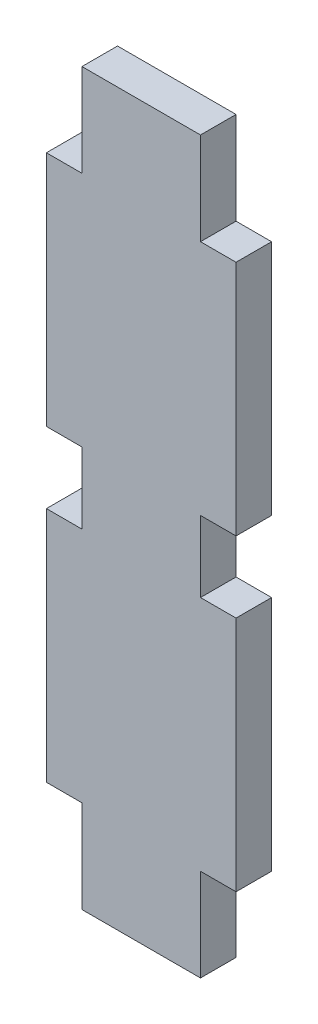
ISO-10303-21;
HEADER;
FILE_DESCRIPTION(('STEP AP214'),'2;1');
FILE_NAME('part.step','',(''),(''),'','','');
FILE_SCHEMA(('AUTOMOTIVE_DESIGN { 1 0 10303 214 1 1 1 1 }'));
ENDSEC;
DATA;
#1=APPLICATION_CONTEXT('core data for automotive mechanical design processes');
#2=APPLICATION_PROTOCOL_DEFINITION('international standard','automotive_design',2000,#1);
#3=PRODUCT_CONTEXT('',#1,'mechanical');
#4=PRODUCT('Part','Part','',(#3));
#5=PRODUCT_RELATED_PRODUCT_CATEGORY('part','',(#4));
#6=PRODUCT_DEFINITION_FORMATION('','',#4);
#7=PRODUCT_DEFINITION_CONTEXT('part definition',#1,'design');
#8=PRODUCT_DEFINITION('design','',#6,#7);
#9=PRODUCT_DEFINITION_SHAPE('','',#8);
#10=(LENGTH_UNIT() NAMED_UNIT(*) SI_UNIT(.MILLI.,.METRE.));
#11=(NAMED_UNIT(*) PLANE_ANGLE_UNIT() SI_UNIT($,.RADIAN.));
#12=(NAMED_UNIT(*) SI_UNIT($,.STERADIAN.) SOLID_ANGLE_UNIT());
#13=UNCERTAINTY_MEASURE_WITH_UNIT(LENGTH_MEASURE(1.E-05),#10,'distance_accuracy_value','');
#14=(GEOMETRIC_REPRESENTATION_CONTEXT(3) GLOBAL_UNCERTAINTY_ASSIGNED_CONTEXT((#13)) GLOBAL_UNIT_ASSIGNED_CONTEXT((#10,
#11,#12)) REPRESENTATION_CONTEXT('',''));
#15=CARTESIAN_POINT('',(0.,0.,0.));
#16=DIRECTION('',(0.,0.,1.));
#17=DIRECTION('',(1.,0.,0.));
#18=AXIS2_PLACEMENT_3D('',#15,#16,#17);
#19=CARTESIAN_POINT('',(3.,-436.000000000001,3.));
#20=DIRECTION('',(0.,-1.,0.));
#21=DIRECTION('',(0.,0.,-1.));
#22=AXIS2_PLACEMENT_3D('',#19,#20,#21);
#23=PLANE('',#22);
#24=DIRECTION('',(-1.,0.,0.));
#25=VECTOR('',#24,1.);
#26=CARTESIAN_POINT('',(3.,-436.000000000001,0.));
#27=LINE('',#26,#25);
#28=CARTESIAN_POINT('',(3.,-436.000000000001,0.));
#29=VERTEX_POINT('',#28);
#30=CARTESIAN_POINT('',(0.,-436.000000000001,0.));
#31=VERTEX_POINT('',#30);
#32=EDGE_CURVE('E207',#29,#31,#27,.T.);
#33=ORIENTED_EDGE('',*,*,#32,.T.);
#34=DIRECTION('',(0.,0.,-1.));
#35=VECTOR('',#34,1.);
#36=CARTESIAN_POINT('',(0.,-436.000000000001,3.));
#37=LINE('',#36,#35);
#38=CARTESIAN_POINT('',(0.,-436.000000000001,3.));
#39=VERTEX_POINT('',#38);
#40=EDGE_CURVE('E11',#39,#31,#37,.T.);
#41=ORIENTED_EDGE('',*,*,#40,.F.);
#42=DIRECTION('',(-1.,0.,0.));
#43=VECTOR('',#42,1.);
#44=CARTESIAN_POINT('',(3.,-436.000000000001,3.));
#45=LINE('',#44,#43);
#46=CARTESIAN_POINT('',(3.,-436.000000000001,3.));
#47=VERTEX_POINT('',#46);
#48=EDGE_CURVE('E245',#47,#39,#45,.T.);
#49=ORIENTED_EDGE('',*,*,#48,.F.);
#50=DIRECTION('',(0.,0.,-1.));
#51=VECTOR('',#50,1.);
#52=CARTESIAN_POINT('',(3.,-436.000000000001,3.));
#53=LINE('',#52,#51);
#54=EDGE_CURVE('E203',#47,#29,#53,.T.);
#55=ORIENTED_EDGE('',*,*,#54,.T.);
#56=EDGE_LOOP('',(#33,#41,#49,#55));
#57=FACE_BOUND('',#56,.T.);
#58=ADVANCED_FACE('F39',(#57),#23,.F.);
#59=CARTESIAN_POINT('',(0.,-436.000000000001,3.));
#60=DIRECTION('',(1.,0.,0.));
#61=DIRECTION('',(0.,0.,-1.));
#62=AXIS2_PLACEMENT_3D('',#59,#60,#61);
#63=PLANE('',#62);
#64=DIRECTION('',(0.,-1.,0.));
#65=VECTOR('',#64,1.);
#66=CARTESIAN_POINT('',(0.,-436.000000000001,0.));
#67=LINE('',#66,#65);
#68=CARTESIAN_POINT('',(0.,-456.000000000001,0.));
#69=VERTEX_POINT('',#68);
#70=EDGE_CURVE('E210',#31,#69,#67,.T.);
#71=ORIENTED_EDGE('',*,*,#70,.T.);
#72=DIRECTION('',(0.,0.,-1.));
#73=VECTOR('',#72,1.);
#74=CARTESIAN_POINT('',(0.,-456.000000000001,3.));
#75=LINE('',#74,#73);
#76=CARTESIAN_POINT('',(0.,-456.000000000001,3.));
#77=VERTEX_POINT('',#76);
#78=EDGE_CURVE('E47',#77,#69,#75,.T.);
#79=ORIENTED_EDGE('',*,*,#78,.F.);
#80=DIRECTION('',(0.,-1.,0.));
#81=VECTOR('',#80,1.);
#82=CARTESIAN_POINT('',(0.,-436.000000000001,3.));
#83=LINE('',#82,#81);
#84=EDGE_CURVE('E134',#39,#77,#83,.T.);
#85=ORIENTED_EDGE('',*,*,#84,.F.);
#86=ORIENTED_EDGE('',*,*,#40,.T.);
#87=EDGE_LOOP('',(#71,#79,#85,#86));
#88=FACE_BOUND('',#87,.T.);
#89=ADVANCED_FACE('F363',(#88),#63,.F.);
#90=CARTESIAN_POINT('',(0.,-456.000000000001,3.));
#91=DIRECTION('',(0.,1.,0.));
#92=DIRECTION('',(0.,0.,1.));
#93=AXIS2_PLACEMENT_3D('',#90,#91,#92);
#94=PLANE('',#93);
#95=DIRECTION('',(1.,0.,0.));
#96=VECTOR('',#95,1.);
#97=CARTESIAN_POINT('',(0.,-456.000000000001,0.));
#98=LINE('',#97,#96);
#99=CARTESIAN_POINT('',(3.,-456.000000000001,0.));
#100=VERTEX_POINT('',#99);
#101=EDGE_CURVE('E212',#69,#100,#98,.T.);
#102=ORIENTED_EDGE('',*,*,#101,.T.);
#103=DIRECTION('',(0.,0.,-1.));
#104=VECTOR('',#103,1.);
#105=CARTESIAN_POINT('',(3.,-456.000000000001,3.));
#106=LINE('',#105,#104);
#107=CARTESIAN_POINT('',(3.,-456.000000000001,3.));
#108=VERTEX_POINT('',#107);
#109=EDGE_CURVE('E288',#108,#100,#106,.T.);
#110=ORIENTED_EDGE('',*,*,#109,.F.);
#111=DIRECTION('',(1.,0.,0.));
#112=VECTOR('',#111,1.);
#113=CARTESIAN_POINT('',(0.,-456.000000000001,3.));
#114=LINE('',#113,#112);
#115=EDGE_CURVE('E296',#77,#108,#114,.T.);
#116=ORIENTED_EDGE('',*,*,#115,.F.);
#117=ORIENTED_EDGE('',*,*,#78,.T.);
#118=EDGE_LOOP('',(#102,#110,#116,#117));
#119=FACE_BOUND('',#118,.T.);
#120=ADVANCED_FACE('F294',(#119),#94,.F.);
#121=CARTESIAN_POINT('',(3.,-456.000000000001,3.));
#122=DIRECTION('',(1.,0.,0.));
#123=DIRECTION('',(0.,0.,-1.));
#124=AXIS2_PLACEMENT_3D('',#121,#122,#123);
#125=PLANE('',#124);
#126=DIRECTION('',(0.,-1.,0.));
#127=VECTOR('',#126,1.);
#128=CARTESIAN_POINT('',(3.,-456.000000000001,0.));
#129=LINE('',#128,#127);
#130=CARTESIAN_POINT('',(3.,-462.000000000001,0.));
#131=VERTEX_POINT('',#130);
#132=EDGE_CURVE('E214',#100,#131,#129,.T.);
#133=ORIENTED_EDGE('',*,*,#132,.T.);
#134=DIRECTION('',(0.,0.,-1.));
#135=VECTOR('',#134,1.);
#136=CARTESIAN_POINT('',(3.,-462.000000000001,3.));
#137=LINE('',#136,#135);
#138=CARTESIAN_POINT('',(3.,-462.000000000001,3.));
#139=VERTEX_POINT('',#138);
#140=EDGE_CURVE('E285',#139,#131,#137,.T.);
#141=ORIENTED_EDGE('',*,*,#140,.F.);
#142=DIRECTION('',(0.,-1.,0.));
#143=VECTOR('',#142,1.);
#144=CARTESIAN_POINT('',(3.,-456.000000000001,3.));
#145=LINE('',#144,#143);
#146=EDGE_CURVE('E314',#108,#139,#145,.T.);
#147=ORIENTED_EDGE('',*,*,#146,.F.);
#148=ORIENTED_EDGE('',*,*,#109,.T.);
#149=EDGE_LOOP('',(#133,#141,#147,#148));
#150=FACE_BOUND('',#149,.T.);
#151=ADVANCED_FACE('F305',(#150),#125,.F.);
#152=CARTESIAN_POINT('',(3.,-462.000000000001,3.));
#153=DIRECTION('',(0.,-1.,0.));
#154=DIRECTION('',(0.,0.,-1.));
#155=AXIS2_PLACEMENT_3D('',#152,#153,#154);
#156=PLANE('',#155);
#157=DIRECTION('',(-1.,0.,0.));
#158=VECTOR('',#157,1.);
#159=CARTESIAN_POINT('',(3.,-462.000000000001,0.));
#160=LINE('',#159,#158);
#161=CARTESIAN_POINT('',(0.,-462.000000000001,0.));
#162=VERTEX_POINT('',#161);
#163=EDGE_CURVE('E216',#131,#162,#160,.T.);
#164=ORIENTED_EDGE('',*,*,#163,.T.);
#165=DIRECTION('',(0.,0.,-1.));
#166=VECTOR('',#165,1.);
#167=CARTESIAN_POINT('',(0.,-462.000000000001,3.));
#168=LINE('',#167,#166);
#169=CARTESIAN_POINT('',(0.,-462.000000000001,3.));
#170=VERTEX_POINT('',#169);
#171=EDGE_CURVE('E282',#170,#162,#168,.T.);
#172=ORIENTED_EDGE('',*,*,#171,.F.);
#173=DIRECTION('',(-1.,0.,0.));
#174=VECTOR('',#173,1.);
#175=CARTESIAN_POINT('',(3.,-462.000000000001,3.));
#176=LINE('',#175,#174);
#177=EDGE_CURVE('E311',#139,#170,#176,.T.);
#178=ORIENTED_EDGE('',*,*,#177,.F.);
#179=ORIENTED_EDGE('',*,*,#140,.T.);
#180=EDGE_LOOP('',(#164,#172,#178,#179));
#181=FACE_BOUND('',#180,.T.);
#182=ADVANCED_FACE('F309',(#181),#156,.F.);
#183=CARTESIAN_POINT('',(0.,-462.000000000001,3.));
#184=DIRECTION('',(1.,0.,0.));
#185=DIRECTION('',(0.,0.,-1.));
#186=AXIS2_PLACEMENT_3D('',#183,#184,#185);
#187=PLANE('',#186);
#188=DIRECTION('',(0.,-1.,0.));
#189=VECTOR('',#188,1.);
#190=CARTESIAN_POINT('',(0.,-462.000000000001,0.));
#191=LINE('',#190,#189);
#192=CARTESIAN_POINT('',(0.,-482.000000000001,0.));
#193=VERTEX_POINT('',#192);
#194=EDGE_CURVE('E218',#162,#193,#191,.T.);
#195=ORIENTED_EDGE('',*,*,#194,.T.);
#196=DIRECTION('',(0.,0.,-1.));
#197=VECTOR('',#196,1.);
#198=CARTESIAN_POINT('',(0.,-482.000000000001,3.));
#199=LINE('',#198,#197);
#200=CARTESIAN_POINT('',(0.,-482.000000000001,3.));
#201=VERTEX_POINT('',#200);
#202=EDGE_CURVE('E279',#201,#193,#199,.T.);
#203=ORIENTED_EDGE('',*,*,#202,.F.);
#204=DIRECTION('',(0.,-1.,0.));
#205=VECTOR('',#204,1.);
#206=CARTESIAN_POINT('',(0.,-462.000000000001,3.));
#207=LINE('',#206,#205);
#208=EDGE_CURVE('E313',#170,#201,#207,.T.);
#209=ORIENTED_EDGE('',*,*,#208,.F.);
#210=ORIENTED_EDGE('',*,*,#171,.T.);
#211=EDGE_LOOP('',(#195,#203,#209,#210));
#212=FACE_BOUND('',#211,.T.);
#213=ADVANCED_FACE('F376',(#212),#187,.F.);
#214=CARTESIAN_POINT('',(0.,-482.000000000001,3.));
#215=DIRECTION('',(0.,1.,0.));
#216=DIRECTION('',(0.,0.,1.));
#217=AXIS2_PLACEMENT_3D('',#214,#215,#216);
#218=PLANE('',#217);
#219=DIRECTION('',(1.,0.,0.));
#220=VECTOR('',#219,1.);
#221=CARTESIAN_POINT('',(0.,-482.000000000001,0.));
#222=LINE('',#221,#220);
#223=CARTESIAN_POINT('',(3.,-482.000000000001,0.));
#224=VERTEX_POINT('',#223);
#225=EDGE_CURVE('E220',#193,#224,#222,.T.);
#226=ORIENTED_EDGE('',*,*,#225,.T.);
#227=DIRECTION('',(0.,0.,-1.));
#228=VECTOR('',#227,1.);
#229=CARTESIAN_POINT('',(3.,-482.000000000001,3.));
#230=LINE('',#229,#228);
#231=CARTESIAN_POINT('',(3.,-482.000000000001,3.));
#232=VERTEX_POINT('',#231);
#233=EDGE_CURVE('E276',#232,#224,#230,.T.);
#234=ORIENTED_EDGE('',*,*,#233,.F.);
#235=DIRECTION('',(1.,0.,0.));
#236=VECTOR('',#235,1.);
#237=CARTESIAN_POINT('',(0.,-482.000000000001,3.));
#238=LINE('',#237,#236);
#239=EDGE_CURVE('E316',#201,#232,#238,.T.);
#240=ORIENTED_EDGE('',*,*,#239,.F.);
#241=ORIENTED_EDGE('',*,*,#202,.T.);
#242=EDGE_LOOP('',(#226,#234,#240,#241));
#243=FACE_BOUND('',#242,.T.);
#244=ADVANCED_FACE('F379',(#243),#218,.F.);
#245=CARTESIAN_POINT('',(3.,-482.000000000001,3.));
#246=DIRECTION('',(1.,0.,0.));
#247=DIRECTION('',(0.,0.,-1.));
#248=AXIS2_PLACEMENT_3D('',#245,#246,#247);
#249=PLANE('',#248);
#250=DIRECTION('',(0.,-1.,0.));
#251=VECTOR('',#250,1.);
#252=CARTESIAN_POINT('',(3.,-482.000000000001,0.));
#253=LINE('',#252,#251);
#254=CARTESIAN_POINT('',(3.,-489.8,0.));
#255=VERTEX_POINT('',#254);
#256=EDGE_CURVE('E222',#224,#255,#253,.T.);
#257=ORIENTED_EDGE('',*,*,#256,.T.);
#258=DIRECTION('',(0.,0.,-1.));
#259=VECTOR('',#258,1.);
#260=CARTESIAN_POINT('',(3.,-489.8,3.));
#261=LINE('',#260,#259);
#262=CARTESIAN_POINT('',(3.,-489.8,3.));
#263=VERTEX_POINT('',#262);
#264=EDGE_CURVE('E273',#263,#255,#261,.T.);
#265=ORIENTED_EDGE('',*,*,#264,.F.);
#266=DIRECTION('',(0.,-1.,0.));
#267=VECTOR('',#266,1.);
#268=CARTESIAN_POINT('',(3.,-482.000000000001,3.));
#269=LINE('',#268,#267);
#270=EDGE_CURVE('E322',#232,#263,#269,.T.);
#271=ORIENTED_EDGE('',*,*,#270,.F.);
#272=ORIENTED_EDGE('',*,*,#233,.T.);
#273=EDGE_LOOP('',(#257,#265,#271,#272));
#274=FACE_BOUND('',#273,.T.);
#275=ADVANCED_FACE('F383',(#274),#249,.F.);
#276=CARTESIAN_POINT('',(3.,-489.8,3.));
#277=DIRECTION('',(0.,1.,0.));
#278=DIRECTION('',(-1.,0.,0.));
#279=AXIS2_PLACEMENT_3D('',#276,#277,#278);
#280=PLANE('',#279);
#281=DIRECTION('',(1.,0.,0.));
#282=VECTOR('',#281,1.);
#283=CARTESIAN_POINT('',(3.,-489.8,0.));
#284=LINE('',#283,#282);
#285=CARTESIAN_POINT('',(13.,-489.8,0.));
#286=VERTEX_POINT('',#285);
#287=EDGE_CURVE('E224',#255,#286,#284,.T.);
#288=ORIENTED_EDGE('',*,*,#287,.T.);
#289=DIRECTION('',(0.,0.,-1.));
#290=VECTOR('',#289,1.);
#291=CARTESIAN_POINT('',(13.,-489.8,3.));
#292=LINE('',#291,#290);
#293=CARTESIAN_POINT('',(13.,-489.8,3.));
#294=VERTEX_POINT('',#293);
#295=EDGE_CURVE('E270',#294,#286,#292,.T.);
#296=ORIENTED_EDGE('',*,*,#295,.F.);
#297=DIRECTION('',(1.,0.,0.));
#298=VECTOR('',#297,1.);
#299=CARTESIAN_POINT('',(3.,-489.8,3.));
#300=LINE('',#299,#298);
#301=EDGE_CURVE('E324',#263,#294,#300,.T.);
#302=ORIENTED_EDGE('',*,*,#301,.F.);
#303=ORIENTED_EDGE('',*,*,#264,.T.);
#304=EDGE_LOOP('',(#288,#296,#302,#303));
#305=FACE_BOUND('',#304,.T.);
#306=ADVANCED_FACE('F387',(#305),#280,.F.);
#307=CARTESIAN_POINT('',(13.,-482.000000000001,3.));
#308=DIRECTION('',(-1.,0.,0.));
#309=DIRECTION('',(0.,-1.,0.));
#310=AXIS2_PLACEMENT_3D('',#307,#308,#309);
#311=PLANE('',#310);
#312=DIRECTION('',(0.,1.,0.));
#313=VECTOR('',#312,1.);
#314=CARTESIAN_POINT('',(13.,-482.000000000001,0.));
#315=LINE('',#314,#313);
#316=CARTESIAN_POINT('',(13.,-482.000000000001,0.));
#317=VERTEX_POINT('',#316);
#318=EDGE_CURVE('E226',#286,#317,#315,.T.);
#319=ORIENTED_EDGE('',*,*,#318,.T.);
#320=DIRECTION('',(0.,0.,-1.));
#321=VECTOR('',#320,1.);
#322=CARTESIAN_POINT('',(13.,-482.000000000001,3.));
#323=LINE('',#322,#321);
#324=CARTESIAN_POINT('',(13.,-482.000000000001,3.));
#325=VERTEX_POINT('',#324);
#326=EDGE_CURVE('E267',#325,#317,#323,.T.);
#327=ORIENTED_EDGE('',*,*,#326,.F.);
#328=DIRECTION('',(0.,1.,0.));
#329=VECTOR('',#328,1.);
#330=CARTESIAN_POINT('',(13.,-482.000000000001,3.));
#331=LINE('',#330,#329);
#332=EDGE_CURVE('E326',#294,#325,#331,.T.);
#333=ORIENTED_EDGE('',*,*,#332,.F.);
#334=ORIENTED_EDGE('',*,*,#295,.T.);
#335=EDGE_LOOP('',(#319,#327,#333,#334));
#336=FACE_BOUND('',#335,.T.);
#337=ADVANCED_FACE('F391',(#336),#311,.F.);
#338=CARTESIAN_POINT('',(16.,-482.000000000001,3.));
#339=DIRECTION('',(0.,1.,0.));
#340=DIRECTION('',(0.,0.,1.));
#341=AXIS2_PLACEMENT_3D('',#338,#339,#340);
#342=PLANE('',#341);
#343=DIRECTION('',(1.,0.,0.));
#344=VECTOR('',#343,1.);
#345=CARTESIAN_POINT('',(16.,-482.000000000001,0.));
#346=LINE('',#345,#344);
#347=CARTESIAN_POINT('',(16.,-482.000000000001,0.));
#348=VERTEX_POINT('',#347);
#349=EDGE_CURVE('E228',#317,#348,#346,.T.);
#350=ORIENTED_EDGE('',*,*,#349,.T.);
#351=DIRECTION('',(0.,0.,-1.));
#352=VECTOR('',#351,1.);
#353=CARTESIAN_POINT('',(16.,-482.000000000001,3.));
#354=LINE('',#353,#352);
#355=CARTESIAN_POINT('',(16.,-482.000000000001,3.));
#356=VERTEX_POINT('',#355);
#357=EDGE_CURVE('E264',#356,#348,#354,.T.);
#358=ORIENTED_EDGE('',*,*,#357,.F.);
#359=DIRECTION('',(1.,0.,0.));
#360=VECTOR('',#359,1.);
#361=CARTESIAN_POINT('',(16.,-482.000000000001,3.));
#362=LINE('',#361,#360);
#363=EDGE_CURVE('E328',#325,#356,#362,.T.);
#364=ORIENTED_EDGE('',*,*,#363,.F.);
#365=ORIENTED_EDGE('',*,*,#326,.T.);
#366=EDGE_LOOP('',(#350,#358,#364,#365));
#367=FACE_BOUND('',#366,.T.);
#368=ADVANCED_FACE('F395',(#367),#342,.F.);
#369=CARTESIAN_POINT('',(16.,-462.000000000001,3.));
#370=DIRECTION('',(-1.,0.,0.));
#371=DIRECTION('',(0.,-1.,0.));
#372=AXIS2_PLACEMENT_3D('',#369,#370,#371);
#373=PLANE('',#372);
#374=DIRECTION('',(0.,1.,0.));
#375=VECTOR('',#374,1.);
#376=CARTESIAN_POINT('',(16.,-462.000000000001,0.));
#377=LINE('',#376,#375);
#378=CARTESIAN_POINT('',(16.,-462.000000000001,0.));
#379=VERTEX_POINT('',#378);
#380=EDGE_CURVE('E230',#348,#379,#377,.T.);
#381=ORIENTED_EDGE('',*,*,#380,.T.);
#382=DIRECTION('',(0.,0.,-1.));
#383=VECTOR('',#382,1.);
#384=CARTESIAN_POINT('',(16.,-462.000000000001,3.));
#385=LINE('',#384,#383);
#386=CARTESIAN_POINT('',(16.,-462.000000000001,3.));
#387=VERTEX_POINT('',#386);
#388=EDGE_CURVE('E261',#387,#379,#385,.T.);
#389=ORIENTED_EDGE('',*,*,#388,.F.);
#390=DIRECTION('',(0.,1.,0.));
#391=VECTOR('',#390,1.);
#392=CARTESIAN_POINT('',(16.,-462.000000000001,3.));
#393=LINE('',#392,#391);
#394=EDGE_CURVE('E330',#356,#387,#393,.T.);
#395=ORIENTED_EDGE('',*,*,#394,.F.);
#396=ORIENTED_EDGE('',*,*,#357,.T.);
#397=EDGE_LOOP('',(#381,#389,#395,#396));
#398=FACE_BOUND('',#397,.T.);
#399=ADVANCED_FACE('F399',(#398),#373,.F.);
#400=CARTESIAN_POINT('',(13.,-462.000000000001,3.));
#401=DIRECTION('',(0.,-1.,0.));
#402=DIRECTION('',(0.,0.,-1.));
#403=AXIS2_PLACEMENT_3D('',#400,#401,#402);
#404=PLANE('',#403);
#405=DIRECTION('',(-1.,0.,0.));
#406=VECTOR('',#405,1.);
#407=CARTESIAN_POINT('',(13.,-462.000000000001,0.));
#408=LINE('',#407,#406);
#409=CARTESIAN_POINT('',(13.,-462.000000000001,0.));
#410=VERTEX_POINT('',#409);
#411=EDGE_CURVE('E232',#379,#410,#408,.T.);
#412=ORIENTED_EDGE('',*,*,#411,.T.);
#413=DIRECTION('',(0.,0.,-1.));
#414=VECTOR('',#413,1.);
#415=CARTESIAN_POINT('',(13.,-462.000000000001,3.));
#416=LINE('',#415,#414);
#417=CARTESIAN_POINT('',(13.,-462.000000000001,3.));
#418=VERTEX_POINT('',#417);
#419=EDGE_CURVE('E258',#418,#410,#416,.T.);
#420=ORIENTED_EDGE('',*,*,#419,.F.);
#421=DIRECTION('',(-1.,0.,0.));
#422=VECTOR('',#421,1.);
#423=CARTESIAN_POINT('',(13.,-462.000000000001,3.));
#424=LINE('',#423,#422);
#425=EDGE_CURVE('E332',#387,#418,#424,.T.);
#426=ORIENTED_EDGE('',*,*,#425,.F.);
#427=ORIENTED_EDGE('',*,*,#388,.T.);
#428=EDGE_LOOP('',(#412,#420,#426,#427));
#429=FACE_BOUND('',#428,.T.);
#430=ADVANCED_FACE('F403',(#429),#404,.F.);
#431=CARTESIAN_POINT('',(13.,-456.000000000001,3.));
#432=DIRECTION('',(-1.,0.,0.));
#433=DIRECTION('',(0.,0.,1.));
#434=AXIS2_PLACEMENT_3D('',#431,#432,#433);
#435=PLANE('',#434);
#436=DIRECTION('',(0.,1.,0.));
#437=VECTOR('',#436,1.);
#438=CARTESIAN_POINT('',(13.,-456.000000000001,0.));
#439=LINE('',#438,#437);
#440=CARTESIAN_POINT('',(13.,-456.000000000001,0.));
#441=VERTEX_POINT('',#440);
#442=EDGE_CURVE('E234',#410,#441,#439,.T.);
#443=ORIENTED_EDGE('',*,*,#442,.T.);
#444=DIRECTION('',(0.,0.,-1.));
#445=VECTOR('',#444,1.);
#446=CARTESIAN_POINT('',(13.,-456.000000000001,3.));
#447=LINE('',#446,#445);
#448=CARTESIAN_POINT('',(13.,-456.000000000001,3.));
#449=VERTEX_POINT('',#448);
#450=EDGE_CURVE('E255',#449,#441,#447,.T.);
#451=ORIENTED_EDGE('',*,*,#450,.F.);
#452=DIRECTION('',(0.,1.,0.));
#453=VECTOR('',#452,1.);
#454=CARTESIAN_POINT('',(13.,-456.000000000001,3.));
#455=LINE('',#454,#453);
#456=EDGE_CURVE('E334',#418,#449,#455,.T.);
#457=ORIENTED_EDGE('',*,*,#456,.F.);
#458=ORIENTED_EDGE('',*,*,#419,.T.);
#459=EDGE_LOOP('',(#443,#451,#457,#458));
#460=FACE_BOUND('',#459,.T.);
#461=ADVANCED_FACE('F407',(#460),#435,.F.);
#462=CARTESIAN_POINT('',(16.,-456.000000000001,3.));
#463=DIRECTION('',(0.,1.,0.));
#464=DIRECTION('',(0.,0.,1.));
#465=AXIS2_PLACEMENT_3D('',#462,#463,#464);
#466=PLANE('',#465);
#467=DIRECTION('',(1.,0.,0.));
#468=VECTOR('',#467,1.);
#469=CARTESIAN_POINT('',(16.,-456.000000000001,0.));
#470=LINE('',#469,#468);
#471=CARTESIAN_POINT('',(16.,-456.000000000001,0.));
#472=VERTEX_POINT('',#471);
#473=EDGE_CURVE('E236',#441,#472,#470,.T.);
#474=ORIENTED_EDGE('',*,*,#473,.T.);
#475=DIRECTION('',(0.,0.,-1.));
#476=VECTOR('',#475,1.);
#477=CARTESIAN_POINT('',(16.,-456.000000000001,3.));
#478=LINE('',#477,#476);
#479=CARTESIAN_POINT('',(16.,-456.000000000001,3.));
#480=VERTEX_POINT('',#479);
#481=EDGE_CURVE('E252',#480,#472,#478,.T.);
#482=ORIENTED_EDGE('',*,*,#481,.F.);
#483=DIRECTION('',(1.,0.,0.));
#484=VECTOR('',#483,1.);
#485=CARTESIAN_POINT('',(16.,-456.000000000001,3.));
#486=LINE('',#485,#484);
#487=EDGE_CURVE('E336',#449,#480,#486,.T.);
#488=ORIENTED_EDGE('',*,*,#487,.F.);
#489=ORIENTED_EDGE('',*,*,#450,.T.);
#490=EDGE_LOOP('',(#474,#482,#488,#489));
#491=FACE_BOUND('',#490,.T.);
#492=ADVANCED_FACE('F411',(#491),#466,.F.);
#493=CARTESIAN_POINT('',(16.,-436.000000000001,3.));
#494=DIRECTION('',(-1.,0.,0.));
#495=DIRECTION('',(0.,-1.,0.));
#496=AXIS2_PLACEMENT_3D('',#493,#494,#495);
#497=PLANE('',#496);
#498=DIRECTION('',(0.,1.,0.));
#499=VECTOR('',#498,1.);
#500=CARTESIAN_POINT('',(16.,-436.000000000001,0.));
#501=LINE('',#500,#499);
#502=CARTESIAN_POINT('',(16.,-436.000000000001,0.));
#503=VERTEX_POINT('',#502);
#504=EDGE_CURVE('E238',#472,#503,#501,.T.);
#505=ORIENTED_EDGE('',*,*,#504,.T.);
#506=DIRECTION('',(0.,0.,-1.));
#507=VECTOR('',#506,1.);
#508=CARTESIAN_POINT('',(16.,-436.000000000001,3.));
#509=LINE('',#508,#507);
#510=CARTESIAN_POINT('',(16.,-436.000000000001,3.));
#511=VERTEX_POINT('',#510);
#512=EDGE_CURVE('E249',#511,#503,#509,.T.);
#513=ORIENTED_EDGE('',*,*,#512,.F.);
#514=DIRECTION('',(0.,1.,0.));
#515=VECTOR('',#514,1.);
#516=CARTESIAN_POINT('',(16.,-436.000000000001,3.));
#517=LINE('',#516,#515);
#518=EDGE_CURVE('E338',#480,#511,#517,.T.);
#519=ORIENTED_EDGE('',*,*,#518,.F.);
#520=ORIENTED_EDGE('',*,*,#481,.T.);
#521=EDGE_LOOP('',(#505,#513,#519,#520));
#522=FACE_BOUND('',#521,.T.);
#523=ADVANCED_FACE('F344',(#522),#497,.F.);
#524=CARTESIAN_POINT('',(13.,-436.000000000001,3.));
#525=DIRECTION('',(0.,-1.,0.));
#526=DIRECTION('',(0.,0.,-1.));
#527=AXIS2_PLACEMENT_3D('',#524,#525,#526);
#528=PLANE('',#527);
#529=DIRECTION('',(-1.,0.,0.));
#530=VECTOR('',#529,1.);
#531=CARTESIAN_POINT('',(13.,-436.000000000001,0.));
#532=LINE('',#531,#530);
#533=CARTESIAN_POINT('',(13.,-436.000000000001,0.));
#534=VERTEX_POINT('',#533);
#535=EDGE_CURVE('E240',#503,#534,#532,.T.);
#536=ORIENTED_EDGE('',*,*,#535,.T.);
#537=DIRECTION('',(0.,0.,-1.));
#538=VECTOR('',#537,1.);
#539=CARTESIAN_POINT('',(13.,-436.000000000001,3.));
#540=LINE('',#539,#538);
#541=CARTESIAN_POINT('',(13.,-436.000000000001,3.));
#542=VERTEX_POINT('',#541);
#543=EDGE_CURVE('E198',#542,#534,#540,.T.);
#544=ORIENTED_EDGE('',*,*,#543,.F.);
#545=DIRECTION('',(-1.,0.,0.));
#546=VECTOR('',#545,1.);
#547=CARTESIAN_POINT('',(13.,-436.000000000001,3.));
#548=LINE('',#547,#546);
#549=EDGE_CURVE('E189',#511,#542,#548,.T.);
#550=ORIENTED_EDGE('',*,*,#549,.F.);
#551=ORIENTED_EDGE('',*,*,#512,.T.);
#552=EDGE_LOOP('',(#536,#544,#550,#551));
#553=FACE_BOUND('',#552,.T.);
#554=ADVANCED_FACE('F348',(#553),#528,.F.);
#555=CARTESIAN_POINT('',(13.,-428.200000000002,3.));
#556=DIRECTION('',(-1.,0.,0.));
#557=DIRECTION('',(0.,0.,1.));
#558=AXIS2_PLACEMENT_3D('',#555,#556,#557);
#559=PLANE('',#558);
#560=DIRECTION('',(0.,1.,0.));
#561=VECTOR('',#560,1.);
#562=CARTESIAN_POINT('',(13.,-428.200000000002,0.));
#563=LINE('',#562,#561);
#564=CARTESIAN_POINT('',(13.,-428.200000000002,0.));
#565=VERTEX_POINT('',#564);
#566=EDGE_CURVE('E197',#534,#565,#563,.T.);
#567=ORIENTED_EDGE('',*,*,#566,.T.);
#568=DIRECTION('',(0.,0.,-1.));
#569=VECTOR('',#568,1.);
#570=CARTESIAN_POINT('',(13.,-428.200000000002,3.));
#571=LINE('',#570,#569);
#572=CARTESIAN_POINT('',(13.,-428.200000000002,3.));
#573=VERTEX_POINT('',#572);
#574=EDGE_CURVE('E194',#573,#565,#571,.T.);
#575=ORIENTED_EDGE('',*,*,#574,.F.);
#576=DIRECTION('',(0.,1.,0.));
#577=VECTOR('',#576,1.);
#578=CARTESIAN_POINT('',(13.,-428.200000000002,3.));
#579=LINE('',#578,#577);
#580=EDGE_CURVE('E183',#542,#573,#579,.T.);
#581=ORIENTED_EDGE('',*,*,#580,.F.);
#582=ORIENTED_EDGE('',*,*,#543,.T.);
#583=EDGE_LOOP('',(#567,#575,#581,#582));
#584=FACE_BOUND('',#583,.T.);
#585=ADVANCED_FACE('F195',(#584),#559,.F.);
#586=CARTESIAN_POINT('',(3.,-428.200000000002,3.));
#587=DIRECTION('',(0.,-1.,0.));
#588=DIRECTION('',(0.,0.,-1.));
#589=AXIS2_PLACEMENT_3D('',#586,#587,#588);
#590=PLANE('',#589);
#591=DIRECTION('',(-1.,0.,0.));
#592=VECTOR('',#591,1.);
#593=CARTESIAN_POINT('',(3.,-428.200000000002,0.));
#594=LINE('',#593,#592);
#595=CARTESIAN_POINT('',(3.,-428.200000000002,0.));
#596=VERTEX_POINT('',#595);
#597=EDGE_CURVE('E120',#565,#596,#594,.T.);
#598=ORIENTED_EDGE('',*,*,#597,.T.);
#599=DIRECTION('',(0.,0.,-1.));
#600=VECTOR('',#599,1.);
#601=CARTESIAN_POINT('',(3.,-428.200000000002,3.));
#602=LINE('',#601,#600);
#603=CARTESIAN_POINT('',(3.,-428.200000000002,3.));
#604=VERTEX_POINT('',#603);
#605=EDGE_CURVE('E199',#604,#596,#602,.T.);
#606=ORIENTED_EDGE('',*,*,#605,.F.);
#607=DIRECTION('',(-1.,0.,0.));
#608=VECTOR('',#607,1.);
#609=CARTESIAN_POINT('',(3.,-428.200000000002,3.));
#610=LINE('',#609,#608);
#611=EDGE_CURVE('E187',#573,#604,#610,.T.);
#612=ORIENTED_EDGE('',*,*,#611,.F.);
#613=ORIENTED_EDGE('',*,*,#574,.T.);
#614=EDGE_LOOP('',(#598,#606,#612,#613));
#615=FACE_BOUND('',#614,.T.);
#616=ADVANCED_FACE('F201',(#615),#590,.F.);
#617=CARTESIAN_POINT('',(3.,-428.200000000002,3.));
#618=DIRECTION('',(1.,0.,0.));
#619=DIRECTION('',(0.,0.,-1.));
#620=AXIS2_PLACEMENT_3D('',#617,#618,#619);
#621=PLANE('',#620);
#622=DIRECTION('',(0.,-1.,0.));
#623=VECTOR('',#622,1.);
#624=CARTESIAN_POINT('',(3.,-428.200000000002,0.));
#625=LINE('',#624,#623);
#626=EDGE_CURVE('E126',#596,#29,#625,.T.);
#627=ORIENTED_EDGE('',*,*,#626,.T.);
#628=ORIENTED_EDGE('',*,*,#54,.F.);
#629=DIRECTION('',(0.,-1.,0.));
#630=VECTOR('',#629,1.);
#631=CARTESIAN_POINT('',(3.,-428.200000000002,3.));
#632=LINE('',#631,#630);
#633=EDGE_CURVE('E55',#604,#47,#632,.T.);
#634=ORIENTED_EDGE('',*,*,#633,.F.);
#635=ORIENTED_EDGE('',*,*,#605,.T.);
#636=EDGE_LOOP('',(#627,#628,#634,#635));
#637=FACE_BOUND('',#636,.T.);
#638=ADVANCED_FACE('F352',(#637),#621,.F.);
#639=CARTESIAN_POINT('',(0.,0.,3.));
#640=DIRECTION('',(0.,0.,1.));
#641=DIRECTION('',(1.,0.,0.));
#642=AXIS2_PLACEMENT_3D('',#639,#640,#641);
#643=PLANE('',#642);
#644=ORIENTED_EDGE('',*,*,#48,.T.);
#645=ORIENTED_EDGE('',*,*,#84,.T.);
#646=ORIENTED_EDGE('',*,*,#115,.T.);
#647=ORIENTED_EDGE('',*,*,#146,.T.);
#648=ORIENTED_EDGE('',*,*,#177,.T.);
#649=ORIENTED_EDGE('',*,*,#208,.T.);
#650=ORIENTED_EDGE('',*,*,#239,.T.);
#651=ORIENTED_EDGE('',*,*,#270,.T.);
#652=ORIENTED_EDGE('',*,*,#301,.T.);
#653=ORIENTED_EDGE('',*,*,#332,.T.);
#654=ORIENTED_EDGE('',*,*,#363,.T.);
#655=ORIENTED_EDGE('',*,*,#394,.T.);
#656=ORIENTED_EDGE('',*,*,#425,.T.);
#657=ORIENTED_EDGE('',*,*,#456,.T.);
#658=ORIENTED_EDGE('',*,*,#487,.T.);
#659=ORIENTED_EDGE('',*,*,#518,.T.);
#660=ORIENTED_EDGE('',*,*,#549,.T.);
#661=ORIENTED_EDGE('',*,*,#580,.T.);
#662=ORIENTED_EDGE('',*,*,#611,.T.);
#663=ORIENTED_EDGE('',*,*,#633,.T.);
#664=EDGE_LOOP('',(#644,#645,#646,#647,#648,#649,#650,#651,#652,#653,#654,#655,#656,#657,#658,
#659,#660,#661,#662,#663));
#665=FACE_BOUND('',#664,.T.);
#666=ADVANCED_FACE('F185',(#665),#643,.T.);
#667=CARTESIAN_POINT('',(0.,0.,0.));
#668=DIRECTION('',(0.,0.,1.));
#669=DIRECTION('',(1.,0.,0.));
#670=AXIS2_PLACEMENT_3D('',#667,#668,#669);
#671=PLANE('',#670);
#672=ORIENTED_EDGE('',*,*,#32,.F.);
#673=ORIENTED_EDGE('',*,*,#626,.F.);
#674=ORIENTED_EDGE('',*,*,#597,.F.);
#675=ORIENTED_EDGE('',*,*,#566,.F.);
#676=ORIENTED_EDGE('',*,*,#535,.F.);
#677=ORIENTED_EDGE('',*,*,#504,.F.);
#678=ORIENTED_EDGE('',*,*,#473,.F.);
#679=ORIENTED_EDGE('',*,*,#442,.F.);
#680=ORIENTED_EDGE('',*,*,#411,.F.);
#681=ORIENTED_EDGE('',*,*,#380,.F.);
#682=ORIENTED_EDGE('',*,*,#349,.F.);
#683=ORIENTED_EDGE('',*,*,#318,.F.);
#684=ORIENTED_EDGE('',*,*,#287,.F.);
#685=ORIENTED_EDGE('',*,*,#256,.F.);
#686=ORIENTED_EDGE('',*,*,#225,.F.);
#687=ORIENTED_EDGE('',*,*,#194,.F.);
#688=ORIENTED_EDGE('',*,*,#163,.F.);
#689=ORIENTED_EDGE('',*,*,#132,.F.);
#690=ORIENTED_EDGE('',*,*,#101,.F.);
#691=ORIENTED_EDGE('',*,*,#70,.F.);
#692=EDGE_LOOP('',(#672,#673,#674,#675,#676,#677,#678,#679,#680,#681,#682,#683,#684,#685,#686,
#687,#688,#689,#690,#691));
#693=FACE_BOUND('',#692,.T.);
#694=ADVANCED_FACE('F300',(#693),#671,.F.);
#695=CLOSED_SHELL('',(#58,#89,#120,#151,#182,#213,#244,#275,#306,#337,#368,#399,#430,#461,#492,
#523,#554,#585,#616,#638,#666,#694));
#696=MANIFOLD_SOLID_BREP('B2',#695);
#697=ADVANCED_BREP_SHAPE_REPRESENTATION('',(#18,#696),#14);
#698=SHAPE_DEFINITION_REPRESENTATION(#9,#697);
ENDSEC;
END-ISO-10303-21;
